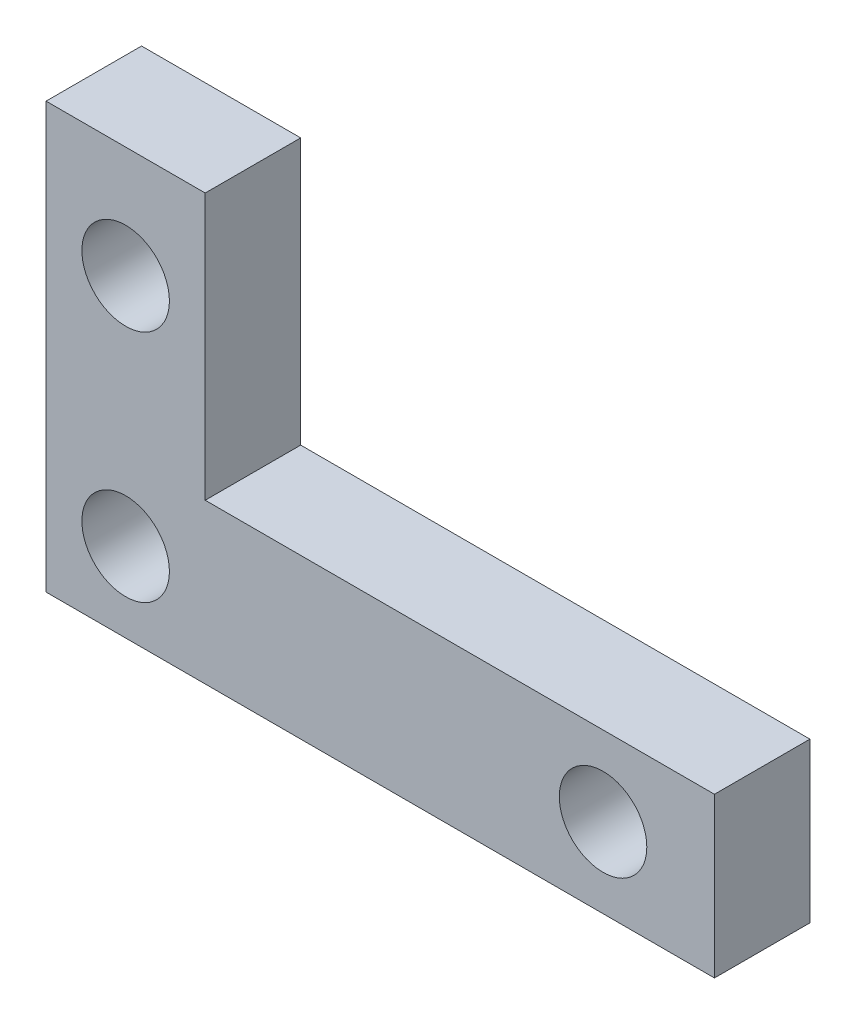
ISO-10303-21;
HEADER;
FILE_DESCRIPTION(('STEP AP214'),'2;1');
FILE_NAME('part.step','',(''),(''),'','','');
FILE_SCHEMA(('AUTOMOTIVE_DESIGN { 1 0 10303 214 1 1 1 1 }'));
ENDSEC;
DATA;
#1=APPLICATION_CONTEXT('core data for automotive mechanical design processes');
#2=APPLICATION_PROTOCOL_DEFINITION('international standard','automotive_design',2000,#1);
#3=PRODUCT_CONTEXT('',#1,'mechanical');
#4=PRODUCT('Part','Part','',(#3));
#5=PRODUCT_RELATED_PRODUCT_CATEGORY('part','',(#4));
#6=PRODUCT_DEFINITION_FORMATION('','',#4);
#7=PRODUCT_DEFINITION_CONTEXT('part definition',#1,'design');
#8=PRODUCT_DEFINITION('design','',#6,#7);
#9=PRODUCT_DEFINITION_SHAPE('','',#8);
#10=(LENGTH_UNIT() NAMED_UNIT(*) SI_UNIT(.MILLI.,.METRE.));
#11=(NAMED_UNIT(*) PLANE_ANGLE_UNIT() SI_UNIT($,.RADIAN.));
#12=(NAMED_UNIT(*) SI_UNIT($,.STERADIAN.) SOLID_ANGLE_UNIT());
#13=UNCERTAINTY_MEASURE_WITH_UNIT(LENGTH_MEASURE(1.E-05),#10,'distance_accuracy_value','');
#14=(GEOMETRIC_REPRESENTATION_CONTEXT(3) GLOBAL_UNCERTAINTY_ASSIGNED_CONTEXT((#13)) GLOBAL_UNIT_ASSIGNED_CONTEXT((#10,
#11,#12)) REPRESENTATION_CONTEXT('',''));
#15=CARTESIAN_POINT('',(0.,0.,0.));
#16=DIRECTION('',(0.,0.,1.));
#17=DIRECTION('',(1.,0.,0.));
#18=AXIS2_PLACEMENT_3D('',#15,#16,#17);
#19=CARTESIAN_POINT('',(0.,0.,3.));
#20=DIRECTION('',(0.,0.,1.));
#21=DIRECTION('',(1.,0.,0.));
#22=AXIS2_PLACEMENT_3D('',#19,#20,#21);
#23=PLANE('',#22);
#24=CARTESIAN_POINT('',(2.5,2.5,3.));
#25=DIRECTION('',(0.,0.,1.));
#26=DIRECTION('',(1.,0.,0.));
#27=AXIS2_PLACEMENT_3D('',#24,#25,#26);
#28=CIRCLE('',#27,1.375);
#29=CARTESIAN_POINT('',(3.875,2.5,3.));
#30=VERTEX_POINT('',#29);
#31=EDGE_CURVE('E213',#30,#30,#28,.T.);
#32=ORIENTED_EDGE('',*,*,#31,.F.);
#33=EDGE_LOOP('',(#32));
#34=FACE_BOUND('',#33,.T.);
#35=DIRECTION('',(0.,-1.,0.));
#36=VECTOR('',#35,1.);
#37=CARTESIAN_POINT('',(0.,13.36,3.));
#38=LINE('',#37,#36);
#39=CARTESIAN_POINT('',(0.,13.36,3.));
#40=VERTEX_POINT('',#39);
#41=CARTESIAN_POINT('',(0.,0.,3.));
#42=VERTEX_POINT('',#41);
#43=EDGE_CURVE('E152',#40,#42,#38,.T.);
#44=ORIENTED_EDGE('',*,*,#43,.T.);
#45=DIRECTION('',(1.,0.,0.));
#46=VECTOR('',#45,1.);
#47=CARTESIAN_POINT('',(0.,0.,3.));
#48=LINE('',#47,#46);
#49=CARTESIAN_POINT('',(21.,0.,3.));
#50=VERTEX_POINT('',#49);
#51=EDGE_CURVE('E100',#42,#50,#48,.T.);
#52=ORIENTED_EDGE('',*,*,#51,.T.);
#53=DIRECTION('',(0.,1.,0.));
#54=VECTOR('',#53,1.);
#55=CARTESIAN_POINT('',(21.,0.,3.));
#56=LINE('',#55,#54);
#57=CARTESIAN_POINT('',(21.,5.,3.));
#58=VERTEX_POINT('',#57);
#59=EDGE_CURVE('E113',#50,#58,#56,.T.);
#60=ORIENTED_EDGE('',*,*,#59,.T.);
#61=DIRECTION('',(-1.,0.,0.));
#62=VECTOR('',#61,1.);
#63=CARTESIAN_POINT('',(21.,5.,3.));
#64=LINE('',#63,#62);
#65=CARTESIAN_POINT('',(5.,5.,3.));
#66=VERTEX_POINT('',#65);
#67=EDGE_CURVE('E107',#58,#66,#64,.T.);
#68=ORIENTED_EDGE('',*,*,#67,.T.);
#69=DIRECTION('',(0.,1.,0.));
#70=VECTOR('',#69,1.);
#71=CARTESIAN_POINT('',(5.,5.,3.));
#72=LINE('',#71,#70);
#73=CARTESIAN_POINT('',(5.,13.36,3.));
#74=VERTEX_POINT('',#73);
#75=EDGE_CURVE('E111',#66,#74,#72,.T.);
#76=ORIENTED_EDGE('',*,*,#75,.T.);
#77=DIRECTION('',(-1.,0.,0.));
#78=VECTOR('',#77,1.);
#79=CARTESIAN_POINT('',(5.,13.36,3.));
#80=LINE('',#79,#78);
#81=EDGE_CURVE('E63',#74,#40,#80,.T.);
#82=ORIENTED_EDGE('',*,*,#81,.T.);
#83=EDGE_LOOP('',(#44,#52,#60,#68,#76,#82));
#84=FACE_BOUND('',#83,.T.);
#85=CARTESIAN_POINT('',(17.5,2.5,3.));
#86=DIRECTION('',(0.,0.,1.));
#87=DIRECTION('',(1.,0.,0.));
#88=AXIS2_PLACEMENT_3D('',#85,#86,#87);
#89=CIRCLE('',#88,1.375);
#90=CARTESIAN_POINT('',(18.875,2.5,3.));
#91=VERTEX_POINT('',#90);
#92=EDGE_CURVE('E140',#91,#91,#89,.T.);
#93=ORIENTED_EDGE('',*,*,#92,.F.);
#94=EDGE_LOOP('',(#93));
#95=FACE_BOUND('',#94,.T.);
#96=CARTESIAN_POINT('',(2.5,9.86,3.));
#97=DIRECTION('',(0.,0.,1.));
#98=DIRECTION('',(1.,0.,0.));
#99=AXIS2_PLACEMENT_3D('',#96,#97,#98);
#100=CIRCLE('',#99,1.375);
#101=CARTESIAN_POINT('',(3.875,9.86,3.));
#102=VERTEX_POINT('',#101);
#103=EDGE_CURVE('E202',#102,#102,#100,.T.);
#104=ORIENTED_EDGE('',*,*,#103,.F.);
#105=EDGE_LOOP('',(#104));
#106=FACE_BOUND('',#105,.T.);
#107=ADVANCED_FACE('F45',(#34,#84,#95,#106),#23,.T.);
#108=CARTESIAN_POINT('',(0.,0.,0.));
#109=DIRECTION('',(0.,0.,1.));
#110=DIRECTION('',(1.,0.,0.));
#111=AXIS2_PLACEMENT_3D('',#108,#109,#110);
#112=PLANE('',#111);
#113=DIRECTION('',(0.,-1.,0.));
#114=VECTOR('',#113,1.);
#115=CARTESIAN_POINT('',(0.,13.36,0.));
#116=LINE('',#115,#114);
#117=CARTESIAN_POINT('',(0.,13.36,0.));
#118=VERTEX_POINT('',#117);
#119=CARTESIAN_POINT('',(0.,0.,0.));
#120=VERTEX_POINT('',#119);
#121=EDGE_CURVE('E135',#118,#120,#116,.T.);
#122=ORIENTED_EDGE('',*,*,#121,.F.);
#123=DIRECTION('',(-1.,0.,0.));
#124=VECTOR('',#123,1.);
#125=CARTESIAN_POINT('',(5.,13.36,0.));
#126=LINE('',#125,#124);
#127=CARTESIAN_POINT('',(5.,13.36,0.));
#128=VERTEX_POINT('',#127);
#129=EDGE_CURVE('E92',#128,#118,#126,.T.);
#130=ORIENTED_EDGE('',*,*,#129,.F.);
#131=DIRECTION('',(0.,1.,0.));
#132=VECTOR('',#131,1.);
#133=CARTESIAN_POINT('',(5.,5.,0.));
#134=LINE('',#133,#132);
#135=CARTESIAN_POINT('',(5.,5.,0.));
#136=VERTEX_POINT('',#135);
#137=EDGE_CURVE('E86',#136,#128,#134,.T.);
#138=ORIENTED_EDGE('',*,*,#137,.F.);
#139=DIRECTION('',(-1.,0.,0.));
#140=VECTOR('',#139,1.);
#141=CARTESIAN_POINT('',(21.,5.,0.));
#142=LINE('',#141,#140);
#143=CARTESIAN_POINT('',(21.,5.,0.));
#144=VERTEX_POINT('',#143);
#145=EDGE_CURVE('E122',#144,#136,#142,.T.);
#146=ORIENTED_EDGE('',*,*,#145,.F.);
#147=DIRECTION('',(0.,1.,0.));
#148=VECTOR('',#147,1.);
#149=CARTESIAN_POINT('',(21.,0.,0.));
#150=LINE('',#149,#148);
#151=CARTESIAN_POINT('',(21.,0.,0.));
#152=VERTEX_POINT('',#151);
#153=EDGE_CURVE('E143',#152,#144,#150,.T.);
#154=ORIENTED_EDGE('',*,*,#153,.F.);
#155=DIRECTION('',(1.,0.,0.));
#156=VECTOR('',#155,1.);
#157=CARTESIAN_POINT('',(0.,0.,0.));
#158=LINE('',#157,#156);
#159=EDGE_CURVE('E139',#120,#152,#158,.T.);
#160=ORIENTED_EDGE('',*,*,#159,.F.);
#161=EDGE_LOOP('',(#122,#130,#138,#146,#154,#160));
#162=FACE_BOUND('',#161,.T.);
#163=CARTESIAN_POINT('',(17.5,2.5,0.));
#164=DIRECTION('',(0.,0.,1.));
#165=DIRECTION('',(1.,0.,0.));
#166=AXIS2_PLACEMENT_3D('',#163,#164,#165);
#167=CIRCLE('',#166,1.375);
#168=CARTESIAN_POINT('',(18.875,2.5,0.));
#169=VERTEX_POINT('',#168);
#170=EDGE_CURVE('E217',#169,#169,#167,.T.);
#171=ORIENTED_EDGE('',*,*,#170,.T.);
#172=EDGE_LOOP('',(#171));
#173=FACE_BOUND('',#172,.T.);
#174=CARTESIAN_POINT('',(2.5,2.5,0.));
#175=DIRECTION('',(0.,0.,1.));
#176=DIRECTION('',(1.,0.,0.));
#177=AXIS2_PLACEMENT_3D('',#174,#175,#176);
#178=CIRCLE('',#177,1.375);
#179=CARTESIAN_POINT('',(3.875,2.5,0.));
#180=VERTEX_POINT('',#179);
#181=EDGE_CURVE('E210',#180,#180,#178,.T.);
#182=ORIENTED_EDGE('',*,*,#181,.T.);
#183=EDGE_LOOP('',(#182));
#184=FACE_BOUND('',#183,.T.);
#185=CARTESIAN_POINT('',(2.5,9.86,0.));
#186=DIRECTION('',(0.,0.,1.));
#187=DIRECTION('',(1.,0.,0.));
#188=AXIS2_PLACEMENT_3D('',#185,#186,#187);
#189=CIRCLE('',#188,1.375);
#190=CARTESIAN_POINT('',(3.875,9.86,0.));
#191=VERTEX_POINT('',#190);
#192=EDGE_CURVE('E205',#191,#191,#189,.T.);
#193=ORIENTED_EDGE('',*,*,#192,.T.);
#194=EDGE_LOOP('',(#193));
#195=FACE_BOUND('',#194,.T.);
#196=ADVANCED_FACE('F165',(#162,#173,#184,#195),#112,.F.);
#197=CARTESIAN_POINT('',(0.,13.36,3.));
#198=DIRECTION('',(1.,0.,0.));
#199=DIRECTION('',(0.,1.,0.));
#200=AXIS2_PLACEMENT_3D('',#197,#198,#199);
#201=PLANE('',#200);
#202=ORIENTED_EDGE('',*,*,#121,.T.);
#203=DIRECTION('',(0.,0.,-1.));
#204=VECTOR('',#203,1.);
#205=CARTESIAN_POINT('',(0.,0.,3.));
#206=LINE('',#205,#204);
#207=EDGE_CURVE('E11',#42,#120,#206,.T.);
#208=ORIENTED_EDGE('',*,*,#207,.F.);
#209=ORIENTED_EDGE('',*,*,#43,.F.);
#210=DIRECTION('',(0.,0.,-1.));
#211=VECTOR('',#210,1.);
#212=CARTESIAN_POINT('',(0.,13.36,3.));
#213=LINE('',#212,#211);
#214=EDGE_CURVE('E131',#40,#118,#213,.T.);
#215=ORIENTED_EDGE('',*,*,#214,.T.);
#216=EDGE_LOOP('',(#202,#208,#209,#215));
#217=FACE_BOUND('',#216,.T.);
#218=ADVANCED_FACE('F47',(#217),#201,.F.);
#219=CARTESIAN_POINT('',(0.,0.,3.));
#220=DIRECTION('',(0.,1.,0.));
#221=DIRECTION('',(0.,0.,1.));
#222=AXIS2_PLACEMENT_3D('',#219,#220,#221);
#223=PLANE('',#222);
#224=ORIENTED_EDGE('',*,*,#159,.T.);
#225=DIRECTION('',(0.,0.,-1.));
#226=VECTOR('',#225,1.);
#227=CARTESIAN_POINT('',(21.,0.,3.));
#228=LINE('',#227,#226);
#229=EDGE_CURVE('E55',#50,#152,#228,.T.);
#230=ORIENTED_EDGE('',*,*,#229,.F.);
#231=ORIENTED_EDGE('',*,*,#51,.F.);
#232=ORIENTED_EDGE('',*,*,#207,.T.);
#233=EDGE_LOOP('',(#224,#230,#231,#232));
#234=FACE_BOUND('',#233,.T.);
#235=ADVANCED_FACE('F276',(#234),#223,.F.);
#236=CARTESIAN_POINT('',(21.,0.,3.));
#237=DIRECTION('',(-1.,0.,0.));
#238=DIRECTION('',(0.,0.,1.));
#239=AXIS2_PLACEMENT_3D('',#236,#237,#238);
#240=PLANE('',#239);
#241=ORIENTED_EDGE('',*,*,#153,.T.);
#242=DIRECTION('',(0.,0.,-1.));
#243=VECTOR('',#242,1.);
#244=CARTESIAN_POINT('',(21.,5.,3.));
#245=LINE('',#244,#243);
#246=EDGE_CURVE('E124',#58,#144,#245,.T.);
#247=ORIENTED_EDGE('',*,*,#246,.F.);
#248=ORIENTED_EDGE('',*,*,#59,.F.);
#249=ORIENTED_EDGE('',*,*,#229,.T.);
#250=EDGE_LOOP('',(#241,#247,#248,#249));
#251=FACE_BOUND('',#250,.T.);
#252=ADVANCED_FACE('F162',(#251),#240,.F.);
#253=CARTESIAN_POINT('',(21.,5.,3.));
#254=DIRECTION('',(0.,-1.,0.));
#255=DIRECTION('',(1.,0.,0.));
#256=AXIS2_PLACEMENT_3D('',#253,#254,#255);
#257=PLANE('',#256);
#258=ORIENTED_EDGE('',*,*,#145,.T.);
#259=DIRECTION('',(0.,0.,-1.));
#260=VECTOR('',#259,1.);
#261=CARTESIAN_POINT('',(5.,5.,3.));
#262=LINE('',#261,#260);
#263=EDGE_CURVE('E119',#66,#136,#262,.T.);
#264=ORIENTED_EDGE('',*,*,#263,.F.);
#265=ORIENTED_EDGE('',*,*,#67,.F.);
#266=ORIENTED_EDGE('',*,*,#246,.T.);
#267=EDGE_LOOP('',(#258,#264,#265,#266));
#268=FACE_BOUND('',#267,.T.);
#269=ADVANCED_FACE('F120',(#268),#257,.F.);
#270=CARTESIAN_POINT('',(5.,5.,3.));
#271=DIRECTION('',(-1.,0.,0.));
#272=DIRECTION('',(0.,0.,1.));
#273=AXIS2_PLACEMENT_3D('',#270,#271,#272);
#274=PLANE('',#273);
#275=ORIENTED_EDGE('',*,*,#137,.T.);
#276=DIRECTION('',(0.,0.,-1.));
#277=VECTOR('',#276,1.);
#278=CARTESIAN_POINT('',(5.,13.36,3.));
#279=LINE('',#278,#277);
#280=EDGE_CURVE('E125',#74,#128,#279,.T.);
#281=ORIENTED_EDGE('',*,*,#280,.F.);
#282=ORIENTED_EDGE('',*,*,#75,.F.);
#283=ORIENTED_EDGE('',*,*,#263,.T.);
#284=EDGE_LOOP('',(#275,#281,#282,#283));
#285=FACE_BOUND('',#284,.T.);
#286=ADVANCED_FACE('F127',(#285),#274,.F.);
#287=CARTESIAN_POINT('',(5.,13.36,3.));
#288=DIRECTION('',(0.,-1.,0.));
#289=DIRECTION('',(0.,0.,-1.));
#290=AXIS2_PLACEMENT_3D('',#287,#288,#289);
#291=PLANE('',#290);
#292=ORIENTED_EDGE('',*,*,#129,.T.);
#293=ORIENTED_EDGE('',*,*,#214,.F.);
#294=ORIENTED_EDGE('',*,*,#81,.F.);
#295=ORIENTED_EDGE('',*,*,#280,.T.);
#296=EDGE_LOOP('',(#292,#293,#294,#295));
#297=FACE_BOUND('',#296,.T.);
#298=ADVANCED_FACE('F170',(#297),#291,.F.);
#299=CARTESIAN_POINT('',(17.5,2.5,3.));
#300=DIRECTION('',(0.,0.,-1.));
#301=DIRECTION('',(-1.,0.,0.));
#302=AXIS2_PLACEMENT_3D('',#299,#300,#301);
#303=CYLINDRICAL_SURFACE('',#302,1.375);
#304=ORIENTED_EDGE('',*,*,#92,.T.);
#305=EDGE_LOOP('',(#304));
#306=FACE_BOUND('',#305,.T.);
#307=ORIENTED_EDGE('',*,*,#170,.F.);
#308=EDGE_LOOP('',(#307));
#309=FACE_BOUND('',#308,.T.);
#310=ADVANCED_FACE('F172',(#306,#309),#303,.F.);
#311=CARTESIAN_POINT('',(2.5,2.5,3.));
#312=DIRECTION('',(0.,0.,-1.));
#313=DIRECTION('',(-1.,0.,0.));
#314=AXIS2_PLACEMENT_3D('',#311,#312,#313);
#315=CYLINDRICAL_SURFACE('',#314,1.375);
#316=ORIENTED_EDGE('',*,*,#31,.T.);
#317=EDGE_LOOP('',(#316));
#318=FACE_BOUND('',#317,.T.);
#319=ORIENTED_EDGE('',*,*,#181,.F.);
#320=EDGE_LOOP('',(#319));
#321=FACE_BOUND('',#320,.T.);
#322=ADVANCED_FACE('F178',(#318,#321),#315,.F.);
#323=CARTESIAN_POINT('',(2.5,9.86,3.));
#324=DIRECTION('',(0.,0.,-1.));
#325=DIRECTION('',(-1.,0.,0.));
#326=AXIS2_PLACEMENT_3D('',#323,#324,#325);
#327=CYLINDRICAL_SURFACE('',#326,1.375);
#328=ORIENTED_EDGE('',*,*,#103,.T.);
#329=EDGE_LOOP('',(#328));
#330=FACE_BOUND('',#329,.T.);
#331=ORIENTED_EDGE('',*,*,#192,.F.);
#332=EDGE_LOOP('',(#331));
#333=FACE_BOUND('',#332,.T.);
#334=ADVANCED_FACE('F193',(#330,#333),#327,.F.);
#335=CLOSED_SHELL('',(#107,#196,#218,#235,#252,#269,#286,#298,#310,#322,#334));
#336=MANIFOLD_SOLID_BREP('B2',#335);
#337=ADVANCED_BREP_SHAPE_REPRESENTATION('',(#18,#336),#14);
#338=SHAPE_DEFINITION_REPRESENTATION(#9,#337);
ENDSEC;
END-ISO-10303-21;
